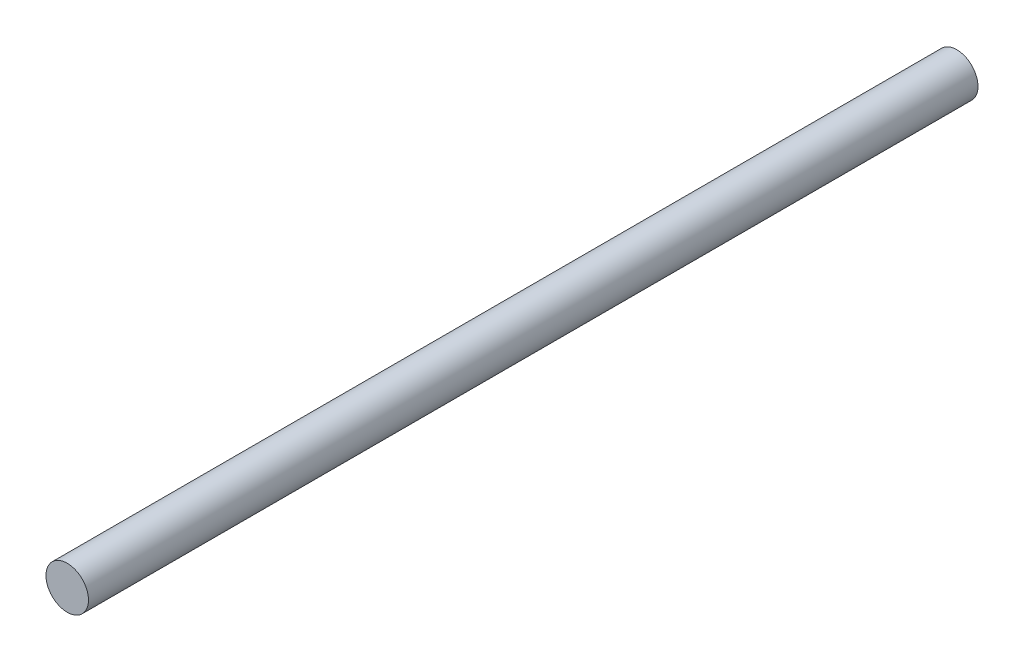
ISO-10303-21;
HEADER;
FILE_DESCRIPTION(('STEP AP214'),'2;1');
FILE_NAME('part.step','',(''),(''),'','','');
FILE_SCHEMA(('AUTOMOTIVE_DESIGN { 1 0 10303 214 1 1 1 1 }'));
ENDSEC;
DATA;
#1=APPLICATION_CONTEXT('core data for automotive mechanical design processes');
#2=APPLICATION_PROTOCOL_DEFINITION('international standard','automotive_design',2000,#1);
#3=PRODUCT_CONTEXT('',#1,'mechanical');
#4=PRODUCT('Part','Part','',(#3));
#5=PRODUCT_RELATED_PRODUCT_CATEGORY('part','',(#4));
#6=PRODUCT_DEFINITION_FORMATION('','',#4);
#7=PRODUCT_DEFINITION_CONTEXT('part definition',#1,'design');
#8=PRODUCT_DEFINITION('design','',#6,#7);
#9=PRODUCT_DEFINITION_SHAPE('','',#8);
#10=(LENGTH_UNIT() NAMED_UNIT(*) SI_UNIT(.MILLI.,.METRE.));
#11=(NAMED_UNIT(*) PLANE_ANGLE_UNIT() SI_UNIT($,.RADIAN.));
#12=(NAMED_UNIT(*) SI_UNIT($,.STERADIAN.) SOLID_ANGLE_UNIT());
#13=UNCERTAINTY_MEASURE_WITH_UNIT(LENGTH_MEASURE(1.E-05),#10,'distance_accuracy_value','');
#14=(GEOMETRIC_REPRESENTATION_CONTEXT(3) GLOBAL_UNCERTAINTY_ASSIGNED_CONTEXT((#13)) GLOBAL_UNIT_ASSIGNED_CONTEXT((#10,
#11,#12)) REPRESENTATION_CONTEXT('',''));
#15=CARTESIAN_POINT('',(0.,0.,0.));
#16=DIRECTION('',(0.,0.,1.));
#17=DIRECTION('',(1.,0.,0.));
#18=AXIS2_PLACEMENT_3D('',#15,#16,#17);
#19=CARTESIAN_POINT('',(0.,0.,97.5));
#20=DIRECTION('',(0.,0.,-1.));
#21=DIRECTION('',(-1.,0.,0.));
#22=AXIS2_PLACEMENT_3D('',#19,#20,#21);
#23=CYLINDRICAL_SURFACE('',#22,2.33);
#24=CARTESIAN_POINT('',(0.,0.,97.5));
#25=DIRECTION('',(0.,0.,1.));
#26=DIRECTION('',(1.,0.,0.));
#27=AXIS2_PLACEMENT_3D('',#24,#25,#26);
#28=CIRCLE('',#27,2.33);
#29=CARTESIAN_POINT('',(2.33,0.,97.5));
#30=VERTEX_POINT('',#29);
#31=EDGE_CURVE('E10',#30,#30,#28,.T.);
#32=ORIENTED_EDGE('',*,*,#31,.F.);
#33=EDGE_LOOP('',(#32));
#34=FACE_BOUND('',#33,.T.);
#35=CARTESIAN_POINT('',(0.,0.,0.));
#36=DIRECTION('',(0.,0.,1.));
#37=DIRECTION('',(1.,0.,0.));
#38=AXIS2_PLACEMENT_3D('',#35,#36,#37);
#39=CIRCLE('',#38,2.33);
#40=CARTESIAN_POINT('',(2.33,0.,0.));
#41=VERTEX_POINT('',#40);
#42=EDGE_CURVE('E36',#41,#41,#39,.T.);
#43=ORIENTED_EDGE('',*,*,#42,.T.);
#44=EDGE_LOOP('',(#43));
#45=FACE_BOUND('',#44,.T.);
#46=ADVANCED_FACE('F33',(#34,#45),#23,.T.);
#47=CARTESIAN_POINT('',(0.,0.,97.5));
#48=DIRECTION('',(0.,0.,1.));
#49=DIRECTION('',(1.,0.,0.));
#50=AXIS2_PLACEMENT_3D('',#47,#48,#49);
#51=PLANE('',#50);
#52=ORIENTED_EDGE('',*,*,#31,.T.);
#53=EDGE_LOOP('',(#52));
#54=FACE_BOUND('',#53,.T.);
#55=ADVANCED_FACE('F49',(#54),#51,.T.);
#56=CARTESIAN_POINT('',(0.,0.,0.));
#57=DIRECTION('',(0.,0.,1.));
#58=DIRECTION('',(1.,0.,0.));
#59=AXIS2_PLACEMENT_3D('',#56,#57,#58);
#60=PLANE('',#59);
#61=ORIENTED_EDGE('',*,*,#42,.F.);
#62=EDGE_LOOP('',(#61));
#63=FACE_BOUND('',#62,.T.);
#64=ADVANCED_FACE('F47',(#63),#60,.F.);
#65=CLOSED_SHELL('',(#46,#55,#64));
#66=MANIFOLD_SOLID_BREP('B2',#65);
#67=ADVANCED_BREP_SHAPE_REPRESENTATION('',(#18,#66),#14);
#68=SHAPE_DEFINITION_REPRESENTATION(#9,#67);
ENDSEC;
END-ISO-10303-21;
